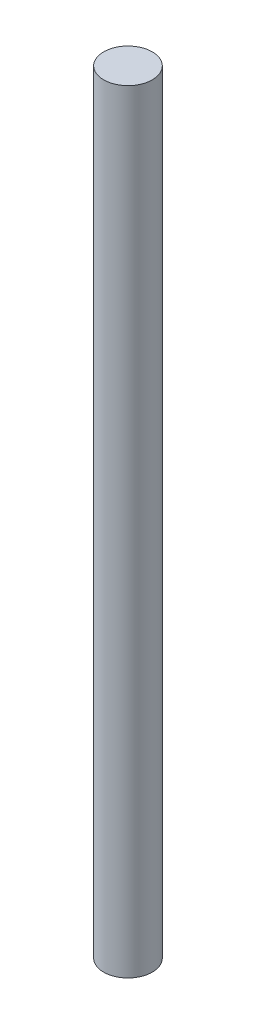
ISO-10303-21;
HEADER;
FILE_DESCRIPTION(('STEP AP214'),'2;1');
FILE_NAME('part.step','',(''),(''),'','','');
FILE_SCHEMA(('AUTOMOTIVE_DESIGN { 1 0 10303 214 1 1 1 1 }'));
ENDSEC;
DATA;
#1=APPLICATION_CONTEXT('core data for automotive mechanical design processes');
#2=APPLICATION_PROTOCOL_DEFINITION('international standard','automotive_design',2000,#1);
#3=PRODUCT_CONTEXT('',#1,'mechanical');
#4=PRODUCT('Part','Part','',(#3));
#5=PRODUCT_RELATED_PRODUCT_CATEGORY('part','',(#4));
#6=PRODUCT_DEFINITION_FORMATION('','',#4);
#7=PRODUCT_DEFINITION_CONTEXT('part definition',#1,'design');
#8=PRODUCT_DEFINITION('design','',#6,#7);
#9=PRODUCT_DEFINITION_SHAPE('','',#8);
#10=(LENGTH_UNIT() NAMED_UNIT(*) SI_UNIT(.MILLI.,.METRE.));
#11=(NAMED_UNIT(*) PLANE_ANGLE_UNIT() SI_UNIT($,.RADIAN.));
#12=(NAMED_UNIT(*) SI_UNIT($,.STERADIAN.) SOLID_ANGLE_UNIT());
#13=UNCERTAINTY_MEASURE_WITH_UNIT(LENGTH_MEASURE(1.E-05),#10,'distance_accuracy_value','');
#14=(GEOMETRIC_REPRESENTATION_CONTEXT(3) GLOBAL_UNCERTAINTY_ASSIGNED_CONTEXT((#13)) GLOBAL_UNIT_ASSIGNED_CONTEXT((#10,
#11,#12)) REPRESENTATION_CONTEXT('',''));
#15=CARTESIAN_POINT('',(0.,0.,0.));
#16=DIRECTION('',(0.,0.,1.));
#17=DIRECTION('',(1.,0.,0.));
#18=AXIS2_PLACEMENT_3D('',#15,#16,#17);
#19=CARTESIAN_POINT('',(0.,875.,0.));
#20=DIRECTION('',(0.,-1.,0.));
#21=DIRECTION('',(0.,0.,-1.));
#22=AXIS2_PLACEMENT_3D('',#19,#20,#21);
#23=CYLINDRICAL_SURFACE('',#22,27.5);
#24=CARTESIAN_POINT('',(0.,875.,0.));
#25=DIRECTION('',(0.,1.,0.));
#26=DIRECTION('',(0.,0.,1.));
#27=AXIS2_PLACEMENT_3D('',#24,#25,#26);
#28=CIRCLE('',#27,27.5);
#29=CARTESIAN_POINT('',(0.,875.,27.5));
#30=VERTEX_POINT('',#29);
#31=EDGE_CURVE('E10',#30,#30,#28,.T.);
#32=ORIENTED_EDGE('',*,*,#31,.F.);
#33=EDGE_LOOP('',(#32));
#34=FACE_BOUND('',#33,.T.);
#35=CARTESIAN_POINT('',(0.,0.,0.));
#36=DIRECTION('',(0.,1.,0.));
#37=DIRECTION('',(0.,0.,1.));
#38=AXIS2_PLACEMENT_3D('',#35,#36,#37);
#39=CIRCLE('',#38,27.5);
#40=CARTESIAN_POINT('',(0.,0.,27.5));
#41=VERTEX_POINT('',#40);
#42=EDGE_CURVE('E40',#41,#41,#39,.T.);
#43=ORIENTED_EDGE('',*,*,#42,.T.);
#44=EDGE_LOOP('',(#43));
#45=FACE_BOUND('',#44,.T.);
#46=ADVANCED_FACE('F37',(#34,#45),#23,.T.);
#47=CARTESIAN_POINT('',(0.,875.,0.));
#48=DIRECTION('',(0.,1.,0.));
#49=DIRECTION('',(0.,0.,1.));
#50=AXIS2_PLACEMENT_3D('',#47,#48,#49);
#51=PLANE('',#50);
#52=ORIENTED_EDGE('',*,*,#31,.T.);
#53=EDGE_LOOP('',(#52));
#54=FACE_BOUND('',#53,.T.);
#55=ADVANCED_FACE('F54',(#54),#51,.T.);
#56=CARTESIAN_POINT('',(0.,0.,0.));
#57=DIRECTION('',(0.,1.,0.));
#58=DIRECTION('',(0.,0.,1.));
#59=AXIS2_PLACEMENT_3D('',#56,#57,#58);
#60=PLANE('',#59);
#61=ORIENTED_EDGE('',*,*,#42,.F.);
#62=EDGE_LOOP('',(#61));
#63=FACE_BOUND('',#62,.T.);
#64=ADVANCED_FACE('F52',(#63),#60,.F.);
#65=CLOSED_SHELL('',(#46,#55,#64));
#66=MANIFOLD_SOLID_BREP('B2',#65);
#67=ADVANCED_BREP_SHAPE_REPRESENTATION('',(#18,#66),#14);
#68=SHAPE_DEFINITION_REPRESENTATION(#9,#67);
ENDSEC;
END-ISO-10303-21;
